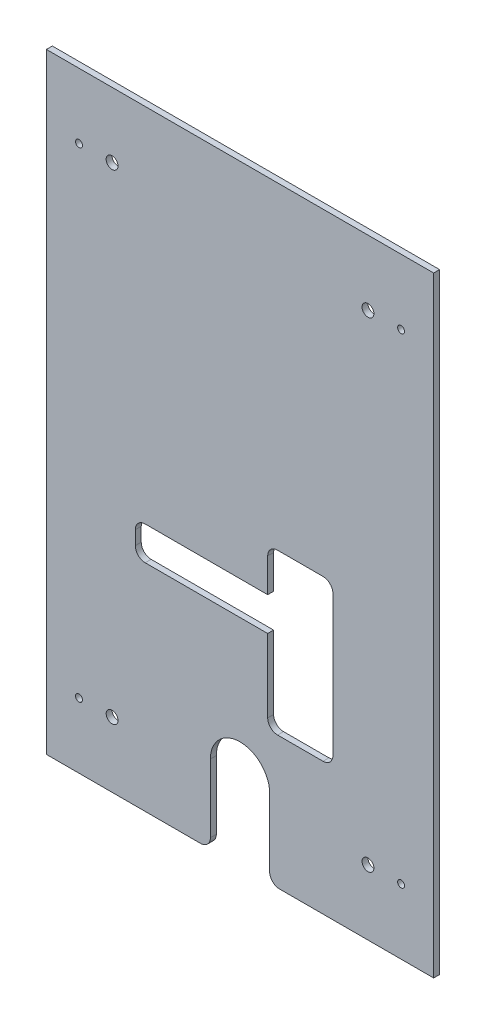
ISO-10303-21;
HEADER;
FILE_DESCRIPTION(('STEP AP214'),'2;1');
FILE_NAME('part.step','',(''),(''),'','','');
FILE_SCHEMA(('AUTOMOTIVE_DESIGN { 1 0 10303 214 1 1 1 1 }'));
ENDSEC;
DATA;
#1=APPLICATION_CONTEXT('core data for automotive mechanical design processes');
#2=APPLICATION_PROTOCOL_DEFINITION('international standard','automotive_design',2000,#1);
#3=PRODUCT_CONTEXT('',#1,'mechanical');
#4=PRODUCT('Part','Part','',(#3));
#5=PRODUCT_RELATED_PRODUCT_CATEGORY('part','',(#4));
#6=PRODUCT_DEFINITION_FORMATION('','',#4);
#7=PRODUCT_DEFINITION_CONTEXT('part definition',#1,'design');
#8=PRODUCT_DEFINITION('design','',#6,#7);
#9=PRODUCT_DEFINITION_SHAPE('','',#8);
#10=(LENGTH_UNIT() NAMED_UNIT(*) SI_UNIT(.MILLI.,.METRE.));
#11=(NAMED_UNIT(*) PLANE_ANGLE_UNIT() SI_UNIT($,.RADIAN.));
#12=(NAMED_UNIT(*) SI_UNIT($,.STERADIAN.) SOLID_ANGLE_UNIT());
#13=UNCERTAINTY_MEASURE_WITH_UNIT(LENGTH_MEASURE(1.E-05),#10,'distance_accuracy_value','');
#14=(GEOMETRIC_REPRESENTATION_CONTEXT(3) GLOBAL_UNCERTAINTY_ASSIGNED_CONTEXT((#13)) GLOBAL_UNIT_ASSIGNED_CONTEXT((#10,
#11,#12)) REPRESENTATION_CONTEXT('',''));
#15=CARTESIAN_POINT('',(0.,0.,0.));
#16=DIRECTION('',(0.,0.,1.));
#17=DIRECTION('',(1.,0.,0.));
#18=AXIS2_PLACEMENT_3D('',#15,#16,#17);
#19=CARTESIAN_POINT('',(98.,-154.5,3.));
#20=DIRECTION('',(0.,1.,0.));
#21=DIRECTION('',(0.,0.,1.));
#22=AXIS2_PLACEMENT_3D('',#19,#20,#21);
#23=PLANE('',#22);
#24=DIRECTION('',(1.,0.,0.));
#25=VECTOR('',#24,1.);
#26=CARTESIAN_POINT('',(98.,-154.5,0.));
#27=LINE('',#26,#25);
#28=CARTESIAN_POINT('',(-98.,-154.5,0.));
#29=VERTEX_POINT('',#28);
#30=CARTESIAN_POINT('',(-20.,-154.5,0.));
#31=VERTEX_POINT('',#30);
#32=EDGE_CURVE('E338',#29,#31,#27,.T.);
#33=ORIENTED_EDGE('',*,*,#32,.T.);
#34=DIRECTION('',(0.,0.,-1.));
#35=VECTOR('',#34,1.);
#36=CARTESIAN_POINT('',(-20.,-154.5,3.));
#37=LINE('',#36,#35);
#38=CARTESIAN_POINT('',(-20.,-154.5,3.));
#39=VERTEX_POINT('',#38);
#40=EDGE_CURVE('E371',#31,#39,#37,.F.);
#41=ORIENTED_EDGE('',*,*,#40,.T.);
#42=DIRECTION('',(1.,0.,0.));
#43=VECTOR('',#42,1.);
#44=CARTESIAN_POINT('',(98.,-154.5,3.));
#45=LINE('',#44,#43);
#46=CARTESIAN_POINT('',(-98.,-154.5,3.));
#47=VERTEX_POINT('',#46);
#48=EDGE_CURVE('E327',#47,#39,#45,.T.);
#49=ORIENTED_EDGE('',*,*,#48,.F.);
#50=DIRECTION('',(0.,0.,-1.));
#51=VECTOR('',#50,1.);
#52=CARTESIAN_POINT('',(-98.,-154.5,3.));
#53=LINE('',#52,#51);
#54=EDGE_CURVE('E352',#47,#29,#53,.T.);
#55=ORIENTED_EDGE('',*,*,#54,.T.);
#56=EDGE_LOOP('',(#33,#41,#49,#55));
#57=FACE_BOUND('',#56,.T.);
#58=ADVANCED_FACE('F45',(#57),#23,.F.);
#59=CARTESIAN_POINT('',(0.,0.,3.));
#60=DIRECTION('',(0.,0.,-1.));
#61=DIRECTION('',(-1.,0.,0.));
#62=AXIS2_PLACEMENT_3D('',#59,#60,#61);
#63=PLANE('',#62);
#64=DIRECTION('',(1.,0.,0.));
#65=VECTOR('',#64,1.);
#66=CARTESIAN_POINT('',(-53.,-45.5,3.));
#67=LINE('',#66,#65);
#68=CARTESIAN_POINT('',(-48.,-45.5,3.));
#69=VERTEX_POINT('',#68);
#70=CARTESIAN_POINT('',(14.,-45.5,3.));
#71=VERTEX_POINT('',#70);
#72=EDGE_CURVE('E235',#69,#71,#67,.T.);
#73=ORIENTED_EDGE('',*,*,#72,.F.);
#74=CARTESIAN_POINT('',(-48.,-40.5,3.));
#75=DIRECTION('',(0.,0.,-1.));
#76=DIRECTION('',(-1.,0.,0.));
#77=AXIS2_PLACEMENT_3D('',#74,#75,#76);
#78=CIRCLE('',#77,5.);
#79=CARTESIAN_POINT('',(-53.,-40.5,3.));
#80=VERTEX_POINT('',#79);
#81=EDGE_CURVE('E401',#69,#80,#78,.T.);
#82=ORIENTED_EDGE('',*,*,#81,.T.);
#83=DIRECTION('',(0.,-1.,0.));
#84=VECTOR('',#83,1.);
#85=CARTESIAN_POINT('',(-53.,-28.5,3.));
#86=LINE('',#85,#84);
#87=CARTESIAN_POINT('',(-53.,-33.5,3.));
#88=VERTEX_POINT('',#87);
#89=EDGE_CURVE('E232',#88,#80,#86,.T.);
#90=ORIENTED_EDGE('',*,*,#89,.F.);
#91=CARTESIAN_POINT('',(-48.,-33.5,3.));
#92=DIRECTION('',(0.,0.,-1.));
#93=DIRECTION('',(-1.,0.,0.));
#94=AXIS2_PLACEMENT_3D('',#91,#92,#93);
#95=CIRCLE('',#94,5.);
#96=CARTESIAN_POINT('',(-48.,-28.5,3.));
#97=VERTEX_POINT('',#96);
#98=EDGE_CURVE('E405',#88,#97,#95,.T.);
#99=ORIENTED_EDGE('',*,*,#98,.T.);
#100=DIRECTION('',(-1.,0.,0.));
#101=VECTOR('',#100,1.);
#102=CARTESIAN_POINT('',(-53.,-28.5,3.));
#103=LINE('',#102,#101);
#104=CARTESIAN_POINT('',(14.,-28.5,3.));
#105=VERTEX_POINT('',#104);
#106=EDGE_CURVE('E250',#105,#97,#103,.T.);
#107=ORIENTED_EDGE('',*,*,#106,.F.);
#108=DIRECTION('',(0.,-1.,0.));
#109=VECTOR('',#108,1.);
#110=CARTESIAN_POINT('',(14.,-6.5,3.));
#111=LINE('',#110,#109);
#112=CARTESIAN_POINT('',(14.,-11.5,3.));
#113=VERTEX_POINT('',#112);
#114=EDGE_CURVE('E217',#113,#105,#111,.T.);
#115=ORIENTED_EDGE('',*,*,#114,.F.);
#116=CARTESIAN_POINT('',(19.,-11.5,3.));
#117=DIRECTION('',(0.,0.,-1.));
#118=DIRECTION('',(-1.,0.,0.));
#119=AXIS2_PLACEMENT_3D('',#116,#117,#118);
#120=CIRCLE('',#119,5.);
#121=CARTESIAN_POINT('',(19.,-6.5,3.));
#122=VERTEX_POINT('',#121);
#123=EDGE_CURVE('E53',#113,#122,#120,.T.);
#124=ORIENTED_EDGE('',*,*,#123,.T.);
#125=DIRECTION('',(-1.,0.,0.));
#126=VECTOR('',#125,1.);
#127=CARTESIAN_POINT('',(47.,-6.49999999999999,3.));
#128=LINE('',#127,#126);
#129=CARTESIAN_POINT('',(42.,-6.49999999999999,3.));
#130=VERTEX_POINT('',#129);
#131=EDGE_CURVE('E246',#130,#122,#128,.T.);
#132=ORIENTED_EDGE('',*,*,#131,.F.);
#133=CARTESIAN_POINT('',(42.,-11.5,3.));
#134=DIRECTION('',(0.,0.,-1.));
#135=DIRECTION('',(-1.,0.,0.));
#136=AXIS2_PLACEMENT_3D('',#133,#134,#135);
#137=CIRCLE('',#136,5.);
#138=CARTESIAN_POINT('',(47.,-11.5,3.));
#139=VERTEX_POINT('',#138);
#140=EDGE_CURVE('E417',#130,#139,#137,.T.);
#141=ORIENTED_EDGE('',*,*,#140,.T.);
#142=DIRECTION('',(0.,1.,0.));
#143=VECTOR('',#142,1.);
#144=CARTESIAN_POINT('',(47.,-6.49999999999999,3.));
#145=LINE('',#144,#143);
#146=CARTESIAN_POINT('',(47.,-82.5,3.));
#147=VERTEX_POINT('',#146);
#148=EDGE_CURVE('E243',#147,#139,#145,.T.);
#149=ORIENTED_EDGE('',*,*,#148,.F.);
#150=CARTESIAN_POINT('',(42.,-82.5,3.));
#151=DIRECTION('',(0.,0.,-1.));
#152=DIRECTION('',(-1.,0.,0.));
#153=AXIS2_PLACEMENT_3D('',#150,#151,#152);
#154=CIRCLE('',#153,5.);
#155=CARTESIAN_POINT('',(42.,-87.5,3.));
#156=VERTEX_POINT('',#155);
#157=EDGE_CURVE('E413',#147,#156,#154,.T.);
#158=ORIENTED_EDGE('',*,*,#157,.T.);
#159=DIRECTION('',(1.,0.,0.));
#160=VECTOR('',#159,1.);
#161=CARTESIAN_POINT('',(47.,-87.5,3.));
#162=LINE('',#161,#160);
#163=CARTESIAN_POINT('',(19.,-87.5,3.));
#164=VERTEX_POINT('',#163);
#165=EDGE_CURVE('E240',#164,#156,#162,.T.);
#166=ORIENTED_EDGE('',*,*,#165,.F.);
#167=CARTESIAN_POINT('',(19.,-82.5,3.));
#168=DIRECTION('',(0.,0.,-1.));
#169=DIRECTION('',(-1.,0.,0.));
#170=AXIS2_PLACEMENT_3D('',#167,#168,#169);
#171=CIRCLE('',#170,5.);
#172=CARTESIAN_POINT('',(14.,-82.5,3.));
#173=VERTEX_POINT('',#172);
#174=EDGE_CURVE('E409',#164,#173,#171,.T.);
#175=ORIENTED_EDGE('',*,*,#174,.T.);
#176=DIRECTION('',(0.,-1.,0.));
#177=VECTOR('',#176,1.);
#178=CARTESIAN_POINT('',(14.,-45.5,3.));
#179=LINE('',#178,#177);
#180=EDGE_CURVE('E237',#71,#173,#179,.T.);
#181=ORIENTED_EDGE('',*,*,#180,.F.);
#182=EDGE_LOOP('',(#73,#82,#90,#99,#107,#115,#124,#132,#141,#149,#158,#166,#175,#181));
#183=FACE_BOUND('',#182,.T.);
#184=DIRECTION('',(0.,1.,0.));
#185=VECTOR('',#184,1.);
#186=CARTESIAN_POINT('',(15.,-154.5,3.));
#187=LINE('',#186,#185);
#188=CARTESIAN_POINT('',(15.,-149.5,3.));
#189=VERTEX_POINT('',#188);
#190=CARTESIAN_POINT('',(15.,-115.,3.));
#191=VERTEX_POINT('',#190);
#192=EDGE_CURVE('E258',#189,#191,#187,.T.);
#193=ORIENTED_EDGE('',*,*,#192,.F.);
#194=CARTESIAN_POINT('',(20.,-149.5,3.));
#195=DIRECTION('',(0.,0.,-1.));
#196=DIRECTION('',(-1.,0.,0.));
#197=AXIS2_PLACEMENT_3D('',#194,#195,#196);
#198=CIRCLE('',#197,5.);
#199=CARTESIAN_POINT('',(20.,-154.5,3.));
#200=VERTEX_POINT('',#199);
#201=EDGE_CURVE('E360',#189,#200,#198,.F.);
#202=ORIENTED_EDGE('',*,*,#201,.T.);
#203=CARTESIAN_POINT('',(98.,-154.5,3.));
#204=VERTEX_POINT('',#203);
#205=EDGE_CURVE('E325',#200,#204,#45,.T.);
#206=ORIENTED_EDGE('',*,*,#205,.T.);
#207=DIRECTION('',(0.,1.,0.));
#208=VECTOR('',#207,1.);
#209=CARTESIAN_POINT('',(98.,154.5,3.));
#210=LINE('',#209,#208);
#211=CARTESIAN_POINT('',(98.,154.5,3.));
#212=VERTEX_POINT('',#211);
#213=EDGE_CURVE('E330',#204,#212,#210,.T.);
#214=ORIENTED_EDGE('',*,*,#213,.T.);
#215=DIRECTION('',(-1.,0.,0.));
#216=VECTOR('',#215,1.);
#217=CARTESIAN_POINT('',(98.,154.5,3.));
#218=LINE('',#217,#216);
#219=CARTESIAN_POINT('',(-98.,154.5,3.));
#220=VERTEX_POINT('',#219);
#221=EDGE_CURVE('E332',#212,#220,#218,.T.);
#222=ORIENTED_EDGE('',*,*,#221,.T.);
#223=DIRECTION('',(0.,-1.,0.));
#224=VECTOR('',#223,1.);
#225=CARTESIAN_POINT('',(-98.,154.5,3.));
#226=LINE('',#225,#224);
#227=EDGE_CURVE('E322',#220,#47,#226,.T.);
#228=ORIENTED_EDGE('',*,*,#227,.T.);
#229=ORIENTED_EDGE('',*,*,#48,.T.);
#230=CARTESIAN_POINT('',(-20.,-149.5,3.));
#231=DIRECTION('',(0.,0.,-1.));
#232=DIRECTION('',(-1.,0.,0.));
#233=AXIS2_PLACEMENT_3D('',#230,#231,#232);
#234=CIRCLE('',#233,5.);
#235=CARTESIAN_POINT('',(-15.,-149.5,3.));
#236=VERTEX_POINT('',#235);
#237=EDGE_CURVE('E358',#39,#236,#234,.F.);
#238=ORIENTED_EDGE('',*,*,#237,.T.);
#239=DIRECTION('',(0.,-1.,0.));
#240=VECTOR('',#239,1.);
#241=CARTESIAN_POINT('',(-15.,-154.5,3.));
#242=LINE('',#241,#240);
#243=CARTESIAN_POINT('',(-15.,-115.,3.));
#244=VERTEX_POINT('',#243);
#245=EDGE_CURVE('E263',#244,#236,#242,.T.);
#246=ORIENTED_EDGE('',*,*,#245,.F.);
#247=CARTESIAN_POINT('',(0.,-115.,3.));
#248=DIRECTION('',(0.,0.,1.));
#249=DIRECTION('',(1.,0.,0.));
#250=AXIS2_PLACEMENT_3D('',#247,#248,#249);
#251=CIRCLE('',#250,15.);
#252=EDGE_CURVE('E260',#191,#244,#251,.T.);
#253=ORIENTED_EDGE('',*,*,#252,.F.);
#254=EDGE_LOOP('',(#193,#202,#206,#214,#222,#228,#229,#238,#246,#253));
#255=FACE_BOUND('',#254,.T.);
#256=CARTESIAN_POINT('',(-81.5,121.5,3.));
#257=DIRECTION('',(0.,0.,1.));
#258=DIRECTION('',(1.,0.,0.));
#259=AXIS2_PLACEMENT_3D('',#256,#257,#258);
#260=CIRCLE('',#259,1.75);
#261=CARTESIAN_POINT('',(-79.75,121.5,3.));
#262=VERTEX_POINT('',#261);
#263=EDGE_CURVE('E316',#262,#262,#260,.T.);
#264=ORIENTED_EDGE('',*,*,#263,.F.);
#265=EDGE_LOOP('',(#264));
#266=FACE_BOUND('',#265,.T.);
#267=CARTESIAN_POINT('',(81.5,121.5,3.));
#268=DIRECTION('',(0.,0.,1.));
#269=DIRECTION('',(-1.,0.,0.));
#270=AXIS2_PLACEMENT_3D('',#267,#268,#269);
#271=CIRCLE('',#270,1.75);
#272=CARTESIAN_POINT('',(79.75,121.5,3.));
#273=VERTEX_POINT('',#272);
#274=EDGE_CURVE('E310',#273,#273,#271,.T.);
#275=ORIENTED_EDGE('',*,*,#274,.F.);
#276=EDGE_LOOP('',(#275));
#277=FACE_BOUND('',#276,.T.);
#278=CARTESIAN_POINT('',(81.5,-121.5,3.));
#279=DIRECTION('',(0.,0.,1.));
#280=DIRECTION('',(1.,0.,0.));
#281=AXIS2_PLACEMENT_3D('',#278,#279,#280);
#282=CIRCLE('',#281,1.75);
#283=CARTESIAN_POINT('',(83.25,-121.5,3.));
#284=VERTEX_POINT('',#283);
#285=EDGE_CURVE('E304',#284,#284,#282,.T.);
#286=ORIENTED_EDGE('',*,*,#285,.F.);
#287=EDGE_LOOP('',(#286));
#288=FACE_BOUND('',#287,.T.);
#289=CARTESIAN_POINT('',(-81.5,-121.5,3.));
#290=DIRECTION('',(0.,0.,1.));
#291=DIRECTION('',(-1.,0.,0.));
#292=AXIS2_PLACEMENT_3D('',#289,#290,#291);
#293=CIRCLE('',#292,1.75);
#294=CARTESIAN_POINT('',(-83.25,-121.5,3.));
#295=VERTEX_POINT('',#294);
#296=EDGE_CURVE('E298',#295,#295,#293,.T.);
#297=ORIENTED_EDGE('',*,*,#296,.F.);
#298=EDGE_LOOP('',(#297));
#299=FACE_BOUND('',#298,.T.);
#300=CARTESIAN_POINT('',(64.75,121.5,3.));
#301=DIRECTION('',(0.,0.,1.));
#302=DIRECTION('',(1.,0.,0.));
#303=AXIS2_PLACEMENT_3D('',#300,#301,#302);
#304=CIRCLE('',#303,3.00000000000001);
#305=CARTESIAN_POINT('',(67.75,121.5,3.));
#306=VERTEX_POINT('',#305);
#307=EDGE_CURVE('E292',#306,#306,#304,.T.);
#308=ORIENTED_EDGE('',*,*,#307,.F.);
#309=EDGE_LOOP('',(#308));
#310=FACE_BOUND('',#309,.T.);
#311=CARTESIAN_POINT('',(-64.7499999999999,121.5,3.));
#312=DIRECTION('',(0.,0.,1.));
#313=DIRECTION('',(-1.,0.,0.));
#314=AXIS2_PLACEMENT_3D('',#311,#312,#313);
#315=CIRCLE('',#314,3.00000000000001);
#316=CARTESIAN_POINT('',(-67.7499999999999,121.5,3.));
#317=VERTEX_POINT('',#316);
#318=EDGE_CURVE('E286',#317,#317,#315,.T.);
#319=ORIENTED_EDGE('',*,*,#318,.F.);
#320=EDGE_LOOP('',(#319));
#321=FACE_BOUND('',#320,.T.);
#322=CARTESIAN_POINT('',(-64.7499999999999,-121.5,3.));
#323=DIRECTION('',(0.,0.,1.));
#324=DIRECTION('',(1.,0.,0.));
#325=AXIS2_PLACEMENT_3D('',#322,#323,#324);
#326=CIRCLE('',#325,3.00000000000001);
#327=CARTESIAN_POINT('',(-61.7499999999999,-121.5,3.));
#328=VERTEX_POINT('',#327);
#329=EDGE_CURVE('E280',#328,#328,#326,.T.);
#330=ORIENTED_EDGE('',*,*,#329,.F.);
#331=EDGE_LOOP('',(#330));
#332=FACE_BOUND('',#331,.T.);
#333=CARTESIAN_POINT('',(64.7500000000001,-121.5,3.));
#334=DIRECTION('',(0.,0.,1.));
#335=DIRECTION('',(-1.,0.,0.));
#336=AXIS2_PLACEMENT_3D('',#333,#334,#335);
#337=CIRCLE('',#336,3.00000000000001);
#338=CARTESIAN_POINT('',(61.75,-121.5,3.));
#339=VERTEX_POINT('',#338);
#340=EDGE_CURVE('E274',#339,#339,#337,.T.);
#341=ORIENTED_EDGE('',*,*,#340,.F.);
#342=EDGE_LOOP('',(#341));
#343=FACE_BOUND('',#342,.T.);
#344=ADVANCED_FACE('F423',(#183,#255,#266,#277,#288,#299,#310,#321,#332,#343),#63,.F.);
#345=CARTESIAN_POINT('',(0.,0.,0.));
#346=DIRECTION('',(0.,0.,-1.));
#347=DIRECTION('',(-1.,0.,0.));
#348=AXIS2_PLACEMENT_3D('',#345,#346,#347);
#349=PLANE('',#348);
#350=DIRECTION('',(-1.,0.,0.));
#351=VECTOR('',#350,1.);
#352=CARTESIAN_POINT('',(-53.,-28.5,0.));
#353=LINE('',#352,#351);
#354=CARTESIAN_POINT('',(14.,-28.5,0.));
#355=VERTEX_POINT('',#354);
#356=CARTESIAN_POINT('',(-48.,-28.5,0.));
#357=VERTEX_POINT('',#356);
#358=EDGE_CURVE('E208',#355,#357,#353,.T.);
#359=ORIENTED_EDGE('',*,*,#358,.T.);
#360=CARTESIAN_POINT('',(-48.,-33.5,0.));
#361=DIRECTION('',(0.,0.,-1.));
#362=DIRECTION('',(-1.,0.,0.));
#363=AXIS2_PLACEMENT_3D('',#360,#361,#362);
#364=CIRCLE('',#363,5.);
#365=CARTESIAN_POINT('',(-53.,-33.5,0.));
#366=VERTEX_POINT('',#365);
#367=EDGE_CURVE('E407',#357,#366,#364,.F.);
#368=ORIENTED_EDGE('',*,*,#367,.T.);
#369=DIRECTION('',(0.,-1.,0.));
#370=VECTOR('',#369,1.);
#371=CARTESIAN_POINT('',(-53.,-28.5,0.));
#372=LINE('',#371,#370);
#373=CARTESIAN_POINT('',(-53.,-40.5,0.));
#374=VERTEX_POINT('',#373);
#375=EDGE_CURVE('E251',#366,#374,#372,.T.);
#376=ORIENTED_EDGE('',*,*,#375,.T.);
#377=CARTESIAN_POINT('',(-48.,-40.5,0.));
#378=DIRECTION('',(0.,0.,-1.));
#379=DIRECTION('',(-1.,0.,0.));
#380=AXIS2_PLACEMENT_3D('',#377,#378,#379);
#381=CIRCLE('',#380,5.);
#382=CARTESIAN_POINT('',(-48.,-45.5,0.));
#383=VERTEX_POINT('',#382);
#384=EDGE_CURVE('E403',#374,#383,#381,.F.);
#385=ORIENTED_EDGE('',*,*,#384,.T.);
#386=DIRECTION('',(1.,0.,0.));
#387=VECTOR('',#386,1.);
#388=CARTESIAN_POINT('',(-53.,-45.5,0.));
#389=LINE('',#388,#387);
#390=CARTESIAN_POINT('',(14.,-45.5,0.));
#391=VERTEX_POINT('',#390);
#392=EDGE_CURVE('E798',#383,#391,#389,.T.);
#393=ORIENTED_EDGE('',*,*,#392,.T.);
#394=DIRECTION('',(0.,-1.,0.));
#395=VECTOR('',#394,1.);
#396=CARTESIAN_POINT('',(14.,-45.5,0.));
#397=LINE('',#396,#395);
#398=CARTESIAN_POINT('',(14.,-82.5,0.));
#399=VERTEX_POINT('',#398);
#400=EDGE_CURVE('E793',#391,#399,#397,.T.);
#401=ORIENTED_EDGE('',*,*,#400,.T.);
#402=CARTESIAN_POINT('',(19.,-82.5,0.));
#403=DIRECTION('',(0.,0.,-1.));
#404=DIRECTION('',(-1.,0.,0.));
#405=AXIS2_PLACEMENT_3D('',#402,#403,#404);
#406=CIRCLE('',#405,5.);
#407=CARTESIAN_POINT('',(19.,-87.5,0.));
#408=VERTEX_POINT('',#407);
#409=EDGE_CURVE('E411',#399,#408,#406,.F.);
#410=ORIENTED_EDGE('',*,*,#409,.T.);
#411=DIRECTION('',(1.,0.,0.));
#412=VECTOR('',#411,1.);
#413=CARTESIAN_POINT('',(47.,-87.5,0.));
#414=LINE('',#413,#412);
#415=CARTESIAN_POINT('',(42.,-87.5,0.));
#416=VERTEX_POINT('',#415);
#417=EDGE_CURVE('E789',#408,#416,#414,.T.);
#418=ORIENTED_EDGE('',*,*,#417,.T.);
#419=CARTESIAN_POINT('',(42.,-82.5,0.));
#420=DIRECTION('',(0.,0.,-1.));
#421=DIRECTION('',(-1.,0.,0.));
#422=AXIS2_PLACEMENT_3D('',#419,#420,#421);
#423=CIRCLE('',#422,5.);
#424=CARTESIAN_POINT('',(47.,-82.5,0.));
#425=VERTEX_POINT('',#424);
#426=EDGE_CURVE('E415',#416,#425,#423,.F.);
#427=ORIENTED_EDGE('',*,*,#426,.T.);
#428=DIRECTION('',(0.,1.,0.));
#429=VECTOR('',#428,1.);
#430=CARTESIAN_POINT('',(47.,-6.49999999999999,0.));
#431=LINE('',#430,#429);
#432=CARTESIAN_POINT('',(47.,-11.5,0.));
#433=VERTEX_POINT('',#432);
#434=EDGE_CURVE('E786',#425,#433,#431,.T.);
#435=ORIENTED_EDGE('',*,*,#434,.T.);
#436=CARTESIAN_POINT('',(42.,-11.5,0.));
#437=DIRECTION('',(0.,0.,-1.));
#438=DIRECTION('',(-1.,0.,0.));
#439=AXIS2_PLACEMENT_3D('',#436,#437,#438);
#440=CIRCLE('',#439,5.);
#441=CARTESIAN_POINT('',(42.,-6.49999999999999,0.));
#442=VERTEX_POINT('',#441);
#443=EDGE_CURVE('E419',#433,#442,#440,.F.);
#444=ORIENTED_EDGE('',*,*,#443,.T.);
#445=DIRECTION('',(-1.,0.,0.));
#446=VECTOR('',#445,1.);
#447=CARTESIAN_POINT('',(47.,-6.49999999999999,0.));
#448=LINE('',#447,#446);
#449=CARTESIAN_POINT('',(19.,-6.5,0.));
#450=VERTEX_POINT('',#449);
#451=EDGE_CURVE('E211',#442,#450,#448,.T.);
#452=ORIENTED_EDGE('',*,*,#451,.T.);
#453=CARTESIAN_POINT('',(19.,-11.5,0.));
#454=DIRECTION('',(0.,0.,-1.));
#455=DIRECTION('',(-1.,0.,0.));
#456=AXIS2_PLACEMENT_3D('',#453,#454,#455);
#457=CIRCLE('',#456,5.);
#458=CARTESIAN_POINT('',(14.,-11.5,0.));
#459=VERTEX_POINT('',#458);
#460=EDGE_CURVE('E11',#450,#459,#457,.F.);
#461=ORIENTED_EDGE('',*,*,#460,.T.);
#462=DIRECTION('',(0.,-1.,0.));
#463=VECTOR('',#462,1.);
#464=CARTESIAN_POINT('',(14.,-6.5,0.));
#465=LINE('',#464,#463);
#466=EDGE_CURVE('E203',#459,#355,#465,.T.);
#467=ORIENTED_EDGE('',*,*,#466,.T.);
#468=EDGE_LOOP('',(#359,#368,#376,#385,#393,#401,#410,#418,#427,#435,#444,#452,#461,#467));
#469=FACE_BOUND('',#468,.T.);
#470=CARTESIAN_POINT('',(20.,-154.5,0.));
#471=VERTEX_POINT('',#470);
#472=CARTESIAN_POINT('',(98.,-154.5,0.));
#473=VERTEX_POINT('',#472);
#474=EDGE_CURVE('E337',#471,#473,#27,.T.);
#475=ORIENTED_EDGE('',*,*,#474,.F.);
#476=CARTESIAN_POINT('',(20.,-149.5,0.));
#477=DIRECTION('',(0.,0.,-1.));
#478=DIRECTION('',(-1.,0.,0.));
#479=AXIS2_PLACEMENT_3D('',#476,#477,#478);
#480=CIRCLE('',#479,5.);
#481=CARTESIAN_POINT('',(15.,-149.5,0.));
#482=VERTEX_POINT('',#481);
#483=EDGE_CURVE('E366',#471,#482,#480,.T.);
#484=ORIENTED_EDGE('',*,*,#483,.T.);
#485=DIRECTION('',(0.,1.,0.));
#486=VECTOR('',#485,1.);
#487=CARTESIAN_POINT('',(15.,-154.5,0.));
#488=LINE('',#487,#486);
#489=CARTESIAN_POINT('',(15.,-115.,0.));
#490=VERTEX_POINT('',#489);
#491=EDGE_CURVE('E269',#482,#490,#488,.T.);
#492=ORIENTED_EDGE('',*,*,#491,.T.);
#493=CARTESIAN_POINT('',(0.,-115.,0.));
#494=DIRECTION('',(0.,0.,-1.));
#495=DIRECTION('',(-1.,0.,0.));
#496=AXIS2_PLACEMENT_3D('',#493,#494,#495);
#497=CIRCLE('',#496,15.);
#498=CARTESIAN_POINT('',(-15.,-115.,0.));
#499=VERTEX_POINT('',#498);
#500=EDGE_CURVE('E221',#490,#499,#497,.F.);
#501=ORIENTED_EDGE('',*,*,#500,.T.);
#502=DIRECTION('',(0.,-1.,0.));
#503=VECTOR('',#502,1.);
#504=CARTESIAN_POINT('',(-15.,-154.5,0.));
#505=LINE('',#504,#503);
#506=CARTESIAN_POINT('',(-15.,-149.5,0.));
#507=VERTEX_POINT('',#506);
#508=EDGE_CURVE('E255',#499,#507,#505,.T.);
#509=ORIENTED_EDGE('',*,*,#508,.T.);
#510=CARTESIAN_POINT('',(-20.,-149.5,0.));
#511=DIRECTION('',(0.,0.,-1.));
#512=DIRECTION('',(-1.,0.,0.));
#513=AXIS2_PLACEMENT_3D('',#510,#511,#512);
#514=CIRCLE('',#513,5.);
#515=EDGE_CURVE('E364',#507,#31,#514,.T.);
#516=ORIENTED_EDGE('',*,*,#515,.T.);
#517=ORIENTED_EDGE('',*,*,#32,.F.);
#518=DIRECTION('',(0.,-1.,0.));
#519=VECTOR('',#518,1.);
#520=CARTESIAN_POINT('',(-98.,154.5,0.));
#521=LINE('',#520,#519);
#522=CARTESIAN_POINT('',(-98.,154.5,0.));
#523=VERTEX_POINT('',#522);
#524=EDGE_CURVE('E319',#523,#29,#521,.T.);
#525=ORIENTED_EDGE('',*,*,#524,.F.);
#526=DIRECTION('',(-1.,0.,0.));
#527=VECTOR('',#526,1.);
#528=CARTESIAN_POINT('',(98.,154.5,0.));
#529=LINE('',#528,#527);
#530=CARTESIAN_POINT('',(98.,154.5,0.));
#531=VERTEX_POINT('',#530);
#532=EDGE_CURVE('E326',#531,#523,#529,.T.);
#533=ORIENTED_EDGE('',*,*,#532,.F.);
#534=DIRECTION('',(0.,1.,0.));
#535=VECTOR('',#534,1.);
#536=CARTESIAN_POINT('',(98.,154.5,0.));
#537=LINE('',#536,#535);
#538=EDGE_CURVE('E341',#473,#531,#537,.T.);
#539=ORIENTED_EDGE('',*,*,#538,.F.);
#540=EDGE_LOOP('',(#475,#484,#492,#501,#509,#516,#517,#525,#533,#539));
#541=FACE_BOUND('',#540,.T.);
#542=CARTESIAN_POINT('',(-64.7499999999999,-121.5,0.));
#543=DIRECTION('',(0.,0.,1.));
#544=DIRECTION('',(1.,0.,0.));
#545=AXIS2_PLACEMENT_3D('',#542,#543,#544);
#546=CIRCLE('',#545,3.00000000000001);
#547=CARTESIAN_POINT('',(-61.7499999999999,-121.5,0.));
#548=VERTEX_POINT('',#547);
#549=EDGE_CURVE('E277',#548,#548,#546,.T.);
#550=ORIENTED_EDGE('',*,*,#549,.T.);
#551=EDGE_LOOP('',(#550));
#552=FACE_BOUND('',#551,.T.);
#553=CARTESIAN_POINT('',(64.75,121.5,0.));
#554=DIRECTION('',(0.,0.,1.));
#555=DIRECTION('',(1.,0.,0.));
#556=AXIS2_PLACEMENT_3D('',#553,#554,#555);
#557=CIRCLE('',#556,3.00000000000001);
#558=CARTESIAN_POINT('',(67.75,121.5,0.));
#559=VERTEX_POINT('',#558);
#560=EDGE_CURVE('E289',#559,#559,#557,.T.);
#561=ORIENTED_EDGE('',*,*,#560,.T.);
#562=EDGE_LOOP('',(#561));
#563=FACE_BOUND('',#562,.T.);
#564=CARTESIAN_POINT('',(81.5,-121.5,0.));
#565=DIRECTION('',(0.,0.,1.));
#566=DIRECTION('',(1.,0.,0.));
#567=AXIS2_PLACEMENT_3D('',#564,#565,#566);
#568=CIRCLE('',#567,1.75);
#569=CARTESIAN_POINT('',(83.25,-121.5,0.));
#570=VERTEX_POINT('',#569);
#571=EDGE_CURVE('E301',#570,#570,#568,.T.);
#572=ORIENTED_EDGE('',*,*,#571,.T.);
#573=EDGE_LOOP('',(#572));
#574=FACE_BOUND('',#573,.T.);
#575=CARTESIAN_POINT('',(-81.5,121.5,0.));
#576=DIRECTION('',(0.,0.,1.));
#577=DIRECTION('',(1.,0.,0.));
#578=AXIS2_PLACEMENT_3D('',#575,#576,#577);
#579=CIRCLE('',#578,1.75);
#580=CARTESIAN_POINT('',(-79.75,121.5,0.));
#581=VERTEX_POINT('',#580);
#582=EDGE_CURVE('E313',#581,#581,#579,.T.);
#583=ORIENTED_EDGE('',*,*,#582,.T.);
#584=EDGE_LOOP('',(#583));
#585=FACE_BOUND('',#584,.T.);
#586=CARTESIAN_POINT('',(81.5,121.5,0.));
#587=DIRECTION('',(0.,0.,1.));
#588=DIRECTION('',(-1.,0.,0.));
#589=AXIS2_PLACEMENT_3D('',#586,#587,#588);
#590=CIRCLE('',#589,1.75);
#591=CARTESIAN_POINT('',(79.75,121.5,0.));
#592=VERTEX_POINT('',#591);
#593=EDGE_CURVE('E307',#592,#592,#590,.T.);
#594=ORIENTED_EDGE('',*,*,#593,.T.);
#595=EDGE_LOOP('',(#594));
#596=FACE_BOUND('',#595,.T.);
#597=CARTESIAN_POINT('',(-81.5,-121.5,0.));
#598=DIRECTION('',(0.,0.,1.));
#599=DIRECTION('',(-1.,0.,0.));
#600=AXIS2_PLACEMENT_3D('',#597,#598,#599);
#601=CIRCLE('',#600,1.75);
#602=CARTESIAN_POINT('',(-83.25,-121.5,0.));
#603=VERTEX_POINT('',#602);
#604=EDGE_CURVE('E295',#603,#603,#601,.T.);
#605=ORIENTED_EDGE('',*,*,#604,.T.);
#606=EDGE_LOOP('',(#605));
#607=FACE_BOUND('',#606,.T.);
#608=CARTESIAN_POINT('',(-64.7499999999999,121.5,0.));
#609=DIRECTION('',(0.,0.,1.));
#610=DIRECTION('',(-1.,0.,0.));
#611=AXIS2_PLACEMENT_3D('',#608,#609,#610);
#612=CIRCLE('',#611,3.00000000000001);
#613=CARTESIAN_POINT('',(-67.7499999999999,121.5,0.));
#614=VERTEX_POINT('',#613);
#615=EDGE_CURVE('E283',#614,#614,#612,.T.);
#616=ORIENTED_EDGE('',*,*,#615,.T.);
#617=EDGE_LOOP('',(#616));
#618=FACE_BOUND('',#617,.T.);
#619=CARTESIAN_POINT('',(64.7500000000001,-121.5,0.));
#620=DIRECTION('',(0.,0.,1.));
#621=DIRECTION('',(-1.,0.,0.));
#622=AXIS2_PLACEMENT_3D('',#619,#620,#621);
#623=CIRCLE('',#622,3.00000000000001);
#624=CARTESIAN_POINT('',(61.75,-121.5,0.));
#625=VERTEX_POINT('',#624);
#626=EDGE_CURVE('E273',#625,#625,#623,.T.);
#627=ORIENTED_EDGE('',*,*,#626,.T.);
#628=EDGE_LOOP('',(#627));
#629=FACE_BOUND('',#628,.T.);
#630=ADVANCED_FACE('F205',(#469,#541,#552,#563,#574,#585,#596,#607,#618,#629),#349,.T.);
#631=CARTESIAN_POINT('',(-98.,154.5,3.));
#632=DIRECTION('',(1.,0.,0.));
#633=DIRECTION('',(0.,0.,-1.));
#634=AXIS2_PLACEMENT_3D('',#631,#632,#633);
#635=PLANE('',#634);
#636=ORIENTED_EDGE('',*,*,#524,.T.);
#637=ORIENTED_EDGE('',*,*,#54,.F.);
#638=ORIENTED_EDGE('',*,*,#227,.F.);
#639=DIRECTION('',(0.,0.,-1.));
#640=VECTOR('',#639,1.);
#641=CARTESIAN_POINT('',(-98.,154.5,3.));
#642=LINE('',#641,#640);
#643=EDGE_CURVE('E334',#220,#523,#642,.T.);
#644=ORIENTED_EDGE('',*,*,#643,.T.);
#645=EDGE_LOOP('',(#636,#637,#638,#644));
#646=FACE_BOUND('',#645,.T.);
#647=ADVANCED_FACE('F449',(#646),#635,.F.);
#648=ORIENTED_EDGE('',*,*,#205,.F.);
#649=DIRECTION('',(0.,0.,1.));
#650=VECTOR('',#649,1.);
#651=CARTESIAN_POINT('',(20.,-154.5,3.));
#652=LINE('',#651,#650);
#653=EDGE_CURVE('E362',#200,#471,#652,.F.);
#654=ORIENTED_EDGE('',*,*,#653,.T.);
#655=ORIENTED_EDGE('',*,*,#474,.T.);
#656=DIRECTION('',(0.,0.,-1.));
#657=VECTOR('',#656,1.);
#658=CARTESIAN_POINT('',(98.,-154.5,3.));
#659=LINE('',#658,#657);
#660=EDGE_CURVE('E349',#204,#473,#659,.T.);
#661=ORIENTED_EDGE('',*,*,#660,.F.);
#662=EDGE_LOOP('',(#648,#654,#655,#661));
#663=FACE_BOUND('',#662,.T.);
#664=ADVANCED_FACE('F439',(#663),#23,.F.);
#665=CARTESIAN_POINT('',(98.,154.5,3.));
#666=DIRECTION('',(-1.,0.,0.));
#667=DIRECTION('',(0.,0.,1.));
#668=AXIS2_PLACEMENT_3D('',#665,#666,#667);
#669=PLANE('',#668);
#670=ORIENTED_EDGE('',*,*,#538,.T.);
#671=DIRECTION('',(0.,0.,-1.));
#672=VECTOR('',#671,1.);
#673=CARTESIAN_POINT('',(98.,154.5,3.));
#674=LINE('',#673,#672);
#675=EDGE_CURVE('E346',#212,#531,#674,.T.);
#676=ORIENTED_EDGE('',*,*,#675,.F.);
#677=ORIENTED_EDGE('',*,*,#213,.F.);
#678=ORIENTED_EDGE('',*,*,#660,.T.);
#679=EDGE_LOOP('',(#670,#676,#677,#678));
#680=FACE_BOUND('',#679,.T.);
#681=ADVANCED_FACE('F448',(#680),#669,.F.);
#682=CARTESIAN_POINT('',(98.,154.5,3.));
#683=DIRECTION('',(0.,-1.,0.));
#684=DIRECTION('',(0.,0.,-1.));
#685=AXIS2_PLACEMENT_3D('',#682,#683,#684);
#686=PLANE('',#685);
#687=ORIENTED_EDGE('',*,*,#532,.T.);
#688=ORIENTED_EDGE('',*,*,#643,.F.);
#689=ORIENTED_EDGE('',*,*,#221,.F.);
#690=ORIENTED_EDGE('',*,*,#675,.T.);
#691=EDGE_LOOP('',(#687,#688,#689,#690));
#692=FACE_BOUND('',#691,.T.);
#693=ADVANCED_FACE('F455',(#692),#686,.F.);
#694=CARTESIAN_POINT('',(-81.5,121.5,3.));
#695=DIRECTION('',(0.,0.,-1.));
#696=DIRECTION('',(-1.,0.,0.));
#697=AXIS2_PLACEMENT_3D('',#694,#695,#696);
#698=CYLINDRICAL_SURFACE('',#697,1.75);
#699=ORIENTED_EDGE('',*,*,#263,.T.);
#700=EDGE_LOOP('',(#699));
#701=FACE_BOUND('',#700,.T.);
#702=ORIENTED_EDGE('',*,*,#582,.F.);
#703=EDGE_LOOP('',(#702));
#704=FACE_BOUND('',#703,.T.);
#705=ADVANCED_FACE('F498',(#701,#704),#698,.F.);
#706=CARTESIAN_POINT('',(81.5,121.5,3.));
#707=DIRECTION('',(0.,0.,-1.));
#708=DIRECTION('',(-1.,0.,0.));
#709=AXIS2_PLACEMENT_3D('',#706,#707,#708);
#710=CYLINDRICAL_SURFACE('',#709,1.75);
#711=ORIENTED_EDGE('',*,*,#274,.T.);
#712=EDGE_LOOP('',(#711));
#713=FACE_BOUND('',#712,.T.);
#714=ORIENTED_EDGE('',*,*,#593,.F.);
#715=EDGE_LOOP('',(#714));
#716=FACE_BOUND('',#715,.T.);
#717=ADVANCED_FACE('F503',(#713,#716),#710,.F.);
#718=CARTESIAN_POINT('',(81.5,-121.5,3.));
#719=DIRECTION('',(0.,0.,-1.));
#720=DIRECTION('',(-1.,0.,0.));
#721=AXIS2_PLACEMENT_3D('',#718,#719,#720);
#722=CYLINDRICAL_SURFACE('',#721,1.75);
#723=ORIENTED_EDGE('',*,*,#285,.T.);
#724=EDGE_LOOP('',(#723));
#725=FACE_BOUND('',#724,.T.);
#726=ORIENTED_EDGE('',*,*,#571,.F.);
#727=EDGE_LOOP('',(#726));
#728=FACE_BOUND('',#727,.T.);
#729=ADVANCED_FACE('F511',(#725,#728),#722,.F.);
#730=CARTESIAN_POINT('',(-81.5,-121.5,3.));
#731=DIRECTION('',(0.,0.,-1.));
#732=DIRECTION('',(-1.,0.,0.));
#733=AXIS2_PLACEMENT_3D('',#730,#731,#732);
#734=CYLINDRICAL_SURFACE('',#733,1.75);
#735=ORIENTED_EDGE('',*,*,#296,.T.);
#736=EDGE_LOOP('',(#735));
#737=FACE_BOUND('',#736,.T.);
#738=ORIENTED_EDGE('',*,*,#604,.F.);
#739=EDGE_LOOP('',(#738));
#740=FACE_BOUND('',#739,.T.);
#741=ADVANCED_FACE('F515',(#737,#740),#734,.F.);
#742=CARTESIAN_POINT('',(64.75,121.5,3.));
#743=DIRECTION('',(0.,0.,-1.));
#744=DIRECTION('',(-1.,0.,0.));
#745=AXIS2_PLACEMENT_3D('',#742,#743,#744);
#746=CYLINDRICAL_SURFACE('',#745,3.00000000000001);
#747=ORIENTED_EDGE('',*,*,#307,.T.);
#748=EDGE_LOOP('',(#747));
#749=FACE_BOUND('',#748,.T.);
#750=ORIENTED_EDGE('',*,*,#560,.F.);
#751=EDGE_LOOP('',(#750));
#752=FACE_BOUND('',#751,.T.);
#753=ADVANCED_FACE('F519',(#749,#752),#746,.F.);
#754=CARTESIAN_POINT('',(-64.7499999999999,121.5,3.));
#755=DIRECTION('',(0.,0.,-1.));
#756=DIRECTION('',(-1.,0.,0.));
#757=AXIS2_PLACEMENT_3D('',#754,#755,#756);
#758=CYLINDRICAL_SURFACE('',#757,3.00000000000001);
#759=ORIENTED_EDGE('',*,*,#318,.T.);
#760=EDGE_LOOP('',(#759));
#761=FACE_BOUND('',#760,.T.);
#762=ORIENTED_EDGE('',*,*,#615,.F.);
#763=EDGE_LOOP('',(#762));
#764=FACE_BOUND('',#763,.T.);
#765=ADVANCED_FACE('F523',(#761,#764),#758,.F.);
#766=CARTESIAN_POINT('',(-64.7499999999999,-121.5,3.));
#767=DIRECTION('',(0.,0.,-1.));
#768=DIRECTION('',(-1.,0.,0.));
#769=AXIS2_PLACEMENT_3D('',#766,#767,#768);
#770=CYLINDRICAL_SURFACE('',#769,3.00000000000001);
#771=ORIENTED_EDGE('',*,*,#329,.T.);
#772=EDGE_LOOP('',(#771));
#773=FACE_BOUND('',#772,.T.);
#774=ORIENTED_EDGE('',*,*,#549,.F.);
#775=EDGE_LOOP('',(#774));
#776=FACE_BOUND('',#775,.T.);
#777=ADVANCED_FACE('F527',(#773,#776),#770,.F.);
#778=CARTESIAN_POINT('',(64.7500000000001,-121.5,3.));
#779=DIRECTION('',(0.,0.,-1.));
#780=DIRECTION('',(-1.,0.,0.));
#781=AXIS2_PLACEMENT_3D('',#778,#779,#780);
#782=CYLINDRICAL_SURFACE('',#781,3.00000000000001);
#783=ORIENTED_EDGE('',*,*,#340,.T.);
#784=EDGE_LOOP('',(#783));
#785=FACE_BOUND('',#784,.T.);
#786=ORIENTED_EDGE('',*,*,#626,.F.);
#787=EDGE_LOOP('',(#786));
#788=FACE_BOUND('',#787,.T.);
#789=ADVANCED_FACE('F531',(#785,#788),#782,.F.);
#790=CARTESIAN_POINT('',(-15.,-154.5,-0.00100000000000013));
#791=DIRECTION('',(-1.,0.,0.));
#792=DIRECTION('',(0.,0.,1.));
#793=AXIS2_PLACEMENT_3D('',#790,#791,#792);
#794=PLANE('',#793);
#795=ORIENTED_EDGE('',*,*,#245,.T.);
#796=DIRECTION('',(0.,0.,-1.));
#797=VECTOR('',#796,1.);
#798=CARTESIAN_POINT('',(-15.,-149.5,-0.00100000000000013));
#799=LINE('',#798,#797);
#800=EDGE_CURVE('E368',#236,#507,#799,.T.);
#801=ORIENTED_EDGE('',*,*,#800,.T.);
#802=ORIENTED_EDGE('',*,*,#508,.F.);
#803=DIRECTION('',(0.,0.,1.));
#804=VECTOR('',#803,1.);
#805=CARTESIAN_POINT('',(-15.,-115.,-0.00100000000000013));
#806=LINE('',#805,#804);
#807=EDGE_CURVE('E267',#499,#244,#806,.T.);
#808=ORIENTED_EDGE('',*,*,#807,.T.);
#809=EDGE_LOOP('',(#795,#801,#802,#808));
#810=FACE_BOUND('',#809,.T.);
#811=ADVANCED_FACE('F481',(#810),#794,.F.);
#812=CARTESIAN_POINT('',(0.,-115.,-0.00100000000000013));
#813=DIRECTION('',(0.,0.,1.));
#814=DIRECTION('',(1.,0.,0.));
#815=AXIS2_PLACEMENT_3D('',#812,#813,#814);
#816=CYLINDRICAL_SURFACE('',#815,15.);
#817=DIRECTION('',(0.,0.,1.));
#818=VECTOR('',#817,1.);
#819=CARTESIAN_POINT('',(15.,-115.,-0.00100000000000013));
#820=LINE('',#819,#818);
#821=EDGE_CURVE('E266',#490,#191,#820,.T.);
#822=ORIENTED_EDGE('',*,*,#821,.T.);
#823=ORIENTED_EDGE('',*,*,#252,.T.);
#824=ORIENTED_EDGE('',*,*,#807,.F.);
#825=ORIENTED_EDGE('',*,*,#500,.F.);
#826=EDGE_LOOP('',(#822,#823,#824,#825));
#827=FACE_BOUND('',#826,.T.);
#828=ADVANCED_FACE('F478',(#827),#816,.F.);
#829=CARTESIAN_POINT('',(15.,-154.5,-0.00100000000000013));
#830=DIRECTION('',(1.,0.,0.));
#831=DIRECTION('',(0.,0.,-1.));
#832=AXIS2_PLACEMENT_3D('',#829,#830,#831);
#833=PLANE('',#832);
#834=ORIENTED_EDGE('',*,*,#491,.F.);
#835=DIRECTION('',(0.,0.,1.));
#836=VECTOR('',#835,1.);
#837=CARTESIAN_POINT('',(15.,-149.5,-0.00100000000000013));
#838=LINE('',#837,#836);
#839=EDGE_CURVE('E355',#482,#189,#838,.T.);
#840=ORIENTED_EDGE('',*,*,#839,.T.);
#841=ORIENTED_EDGE('',*,*,#192,.T.);
#842=ORIENTED_EDGE('',*,*,#821,.F.);
#843=EDGE_LOOP('',(#834,#840,#841,#842));
#844=FACE_BOUND('',#843,.T.);
#845=ADVANCED_FACE('F473',(#844),#833,.F.);
#846=CARTESIAN_POINT('',(20.,-149.5,-0.00100000000000013));
#847=DIRECTION('',(0.,0.,1.));
#848=DIRECTION('',(1.,0.,0.));
#849=AXIS2_PLACEMENT_3D('',#846,#847,#848);
#850=CYLINDRICAL_SURFACE('',#849,5.);
#851=ORIENTED_EDGE('',*,*,#483,.F.);
#852=ORIENTED_EDGE('',*,*,#653,.F.);
#853=ORIENTED_EDGE('',*,*,#201,.F.);
#854=ORIENTED_EDGE('',*,*,#839,.F.);
#855=EDGE_LOOP('',(#851,#852,#853,#854));
#856=FACE_BOUND('',#855,.T.);
#857=ADVANCED_FACE('F466',(#856),#850,.T.);
#858=CARTESIAN_POINT('',(-20.,-149.5,-0.00100000000000013));
#859=DIRECTION('',(0.,0.,-1.));
#860=DIRECTION('',(-1.,0.,0.));
#861=AXIS2_PLACEMENT_3D('',#858,#859,#860);
#862=CYLINDRICAL_SURFACE('',#861,5.);
#863=ORIENTED_EDGE('',*,*,#237,.F.);
#864=ORIENTED_EDGE('',*,*,#40,.F.);
#865=ORIENTED_EDGE('',*,*,#515,.F.);
#866=ORIENTED_EDGE('',*,*,#800,.F.);
#867=EDGE_LOOP('',(#863,#864,#865,#866));
#868=FACE_BOUND('',#867,.T.);
#869=ADVANCED_FACE('F486',(#868),#862,.T.);
#870=CARTESIAN_POINT('',(-53.,-28.5,0.));
#871=DIRECTION('',(-1.,0.,0.));
#872=DIRECTION('',(0.,0.,1.));
#873=AXIS2_PLACEMENT_3D('',#870,#871,#872);
#874=PLANE('',#873);
#875=ORIENTED_EDGE('',*,*,#89,.T.);
#876=DIRECTION('',(0.,0.,1.));
#877=VECTOR('',#876,1.);
#878=CARTESIAN_POINT('',(-53.,-40.5,0.));
#879=LINE('',#878,#877);
#880=EDGE_CURVE('E379',#80,#374,#879,.F.);
#881=ORIENTED_EDGE('',*,*,#880,.T.);
#882=ORIENTED_EDGE('',*,*,#375,.F.);
#883=DIRECTION('',(0.,0.,1.));
#884=VECTOR('',#883,1.);
#885=CARTESIAN_POINT('',(-53.,-33.5,3.));
#886=LINE('',#885,#884);
#887=EDGE_CURVE('E376',#366,#88,#886,.T.);
#888=ORIENTED_EDGE('',*,*,#887,.T.);
#889=EDGE_LOOP('',(#875,#881,#882,#888));
#890=FACE_BOUND('',#889,.T.);
#891=ADVANCED_FACE('F540',(#890),#874,.F.);
#892=CARTESIAN_POINT('',(-53.,-28.5,0.));
#893=DIRECTION('',(0.,1.,0.));
#894=DIRECTION('',(0.,0.,1.));
#895=AXIS2_PLACEMENT_3D('',#892,#893,#894);
#896=PLANE('',#895);
#897=ORIENTED_EDGE('',*,*,#106,.T.);
#898=DIRECTION('',(0.,0.,1.));
#899=VECTOR('',#898,1.);
#900=CARTESIAN_POINT('',(-48.,-28.5,0.));
#901=LINE('',#900,#899);
#902=EDGE_CURVE('E226',#97,#357,#901,.F.);
#903=ORIENTED_EDGE('',*,*,#902,.T.);
#904=ORIENTED_EDGE('',*,*,#358,.F.);
#905=DIRECTION('',(0.,0.,1.));
#906=VECTOR('',#905,1.);
#907=CARTESIAN_POINT('',(14.,-28.5,0.));
#908=LINE('',#907,#906);
#909=EDGE_CURVE('E214',#355,#105,#908,.T.);
#910=ORIENTED_EDGE('',*,*,#909,.T.);
#911=EDGE_LOOP('',(#897,#903,#904,#910));
#912=FACE_BOUND('',#911,.T.);
#913=ADVANCED_FACE('F224',(#912),#896,.F.);
#914=CARTESIAN_POINT('',(14.,-6.5,0.));
#915=DIRECTION('',(-1.,0.,0.));
#916=DIRECTION('',(0.,-1.,0.));
#917=AXIS2_PLACEMENT_3D('',#914,#915,#916);
#918=PLANE('',#917);
#919=ORIENTED_EDGE('',*,*,#466,.F.);
#920=DIRECTION('',(0.,0.,1.));
#921=VECTOR('',#920,1.);
#922=CARTESIAN_POINT('',(14.,-11.5,3.));
#923=LINE('',#922,#921);
#924=EDGE_CURVE('E399',#459,#113,#923,.T.);
#925=ORIENTED_EDGE('',*,*,#924,.T.);
#926=ORIENTED_EDGE('',*,*,#114,.T.);
#927=ORIENTED_EDGE('',*,*,#909,.F.);
#928=EDGE_LOOP('',(#919,#925,#926,#927));
#929=FACE_BOUND('',#928,.T.);
#930=ADVANCED_FACE('F215',(#929),#918,.F.);
#931=CARTESIAN_POINT('',(47.,-6.49999999999999,0.));
#932=DIRECTION('',(0.,1.,0.));
#933=DIRECTION('',(-1.,0.,0.));
#934=AXIS2_PLACEMENT_3D('',#931,#932,#933);
#935=PLANE('',#934);
#936=ORIENTED_EDGE('',*,*,#451,.F.);
#937=DIRECTION('',(0.,0.,1.));
#938=VECTOR('',#937,1.);
#939=CARTESIAN_POINT('',(42.,-6.49999999999999,3.));
#940=LINE('',#939,#938);
#941=EDGE_CURVE('E396',#442,#130,#940,.T.);
#942=ORIENTED_EDGE('',*,*,#941,.T.);
#943=ORIENTED_EDGE('',*,*,#131,.T.);
#944=DIRECTION('',(0.,0.,1.));
#945=VECTOR('',#944,1.);
#946=CARTESIAN_POINT('',(19.,-6.5,0.));
#947=LINE('',#946,#945);
#948=EDGE_CURVE('E394',#122,#450,#947,.F.);
#949=ORIENTED_EDGE('',*,*,#948,.T.);
#950=EDGE_LOOP('',(#936,#942,#943,#949));
#951=FACE_BOUND('',#950,.T.);
#952=ADVANCED_FACE('F427',(#951),#935,.F.);
#953=CARTESIAN_POINT('',(47.,-6.49999999999999,0.));
#954=DIRECTION('',(1.,0.,0.));
#955=DIRECTION('',(0.,1.,0.));
#956=AXIS2_PLACEMENT_3D('',#953,#954,#955);
#957=PLANE('',#956);
#958=ORIENTED_EDGE('',*,*,#434,.F.);
#959=DIRECTION('',(0.,0.,1.));
#960=VECTOR('',#959,1.);
#961=CARTESIAN_POINT('',(47.,-82.5,3.));
#962=LINE('',#961,#960);
#963=EDGE_CURVE('E391',#425,#147,#962,.T.);
#964=ORIENTED_EDGE('',*,*,#963,.T.);
#965=ORIENTED_EDGE('',*,*,#148,.T.);
#966=DIRECTION('',(0.,0.,1.));
#967=VECTOR('',#966,1.);
#968=CARTESIAN_POINT('',(47.,-11.5,0.));
#969=LINE('',#968,#967);
#970=EDGE_CURVE('E389',#139,#433,#969,.F.);
#971=ORIENTED_EDGE('',*,*,#970,.T.);
#972=EDGE_LOOP('',(#958,#964,#965,#971));
#973=FACE_BOUND('',#972,.T.);
#974=ADVANCED_FACE('F556',(#973),#957,.F.);
#975=CARTESIAN_POINT('',(47.,-87.5,0.));
#976=DIRECTION('',(0.,-1.,0.));
#977=DIRECTION('',(0.,0.,-1.));
#978=AXIS2_PLACEMENT_3D('',#975,#976,#977);
#979=PLANE('',#978);
#980=ORIENTED_EDGE('',*,*,#417,.F.);
#981=DIRECTION('',(0.,0.,1.));
#982=VECTOR('',#981,1.);
#983=CARTESIAN_POINT('',(19.,-87.5,3.));
#984=LINE('',#983,#982);
#985=EDGE_CURVE('E384',#408,#164,#984,.T.);
#986=ORIENTED_EDGE('',*,*,#985,.T.);
#987=ORIENTED_EDGE('',*,*,#165,.T.);
#988=DIRECTION('',(0.,0.,1.));
#989=VECTOR('',#988,1.);
#990=CARTESIAN_POINT('',(42.,-87.5,0.));
#991=LINE('',#990,#989);
#992=EDGE_CURVE('E382',#156,#416,#991,.F.);
#993=ORIENTED_EDGE('',*,*,#992,.T.);
#994=EDGE_LOOP('',(#980,#986,#987,#993));
#995=FACE_BOUND('',#994,.T.);
#996=ADVANCED_FACE('F552',(#995),#979,.F.);
#997=CARTESIAN_POINT('',(14.,-45.5,0.));
#998=DIRECTION('',(-1.,0.,0.));
#999=DIRECTION('',(0.,-1.,0.));
#1000=AXIS2_PLACEMENT_3D('',#997,#998,#999);
#1001=PLANE('',#1000);
#1002=ORIENTED_EDGE('',*,*,#180,.T.);
#1003=DIRECTION('',(0.,0.,1.));
#1004=VECTOR('',#1003,1.);
#1005=CARTESIAN_POINT('',(14.,-82.5,0.));
#1006=LINE('',#1005,#1004);
#1007=EDGE_CURVE('E387',#173,#399,#1006,.F.);
#1008=ORIENTED_EDGE('',*,*,#1007,.T.);
#1009=ORIENTED_EDGE('',*,*,#400,.F.);
#1010=DIRECTION('',(0.,0.,1.));
#1011=VECTOR('',#1010,1.);
#1012=CARTESIAN_POINT('',(14.,-45.5,0.));
#1013=LINE('',#1012,#1011);
#1014=EDGE_CURVE('E222',#391,#71,#1013,.T.);
#1015=ORIENTED_EDGE('',*,*,#1014,.T.);
#1016=EDGE_LOOP('',(#1002,#1008,#1009,#1015));
#1017=FACE_BOUND('',#1016,.T.);
#1018=ADVANCED_FACE('F548',(#1017),#1001,.F.);
#1019=CARTESIAN_POINT('',(-53.,-45.5,0.));
#1020=DIRECTION('',(0.,-1.,0.));
#1021=DIRECTION('',(0.,0.,-1.));
#1022=AXIS2_PLACEMENT_3D('',#1019,#1020,#1021);
#1023=PLANE('',#1022);
#1024=ORIENTED_EDGE('',*,*,#392,.F.);
#1025=DIRECTION('',(0.,0.,1.));
#1026=VECTOR('',#1025,1.);
#1027=CARTESIAN_POINT('',(-48.,-45.5,3.));
#1028=LINE('',#1027,#1026);
#1029=EDGE_CURVE('E373',#383,#69,#1028,.T.);
#1030=ORIENTED_EDGE('',*,*,#1029,.T.);
#1031=ORIENTED_EDGE('',*,*,#72,.T.);
#1032=ORIENTED_EDGE('',*,*,#1014,.F.);
#1033=EDGE_LOOP('',(#1024,#1030,#1031,#1032));
#1034=FACE_BOUND('',#1033,.T.);
#1035=ADVANCED_FACE('F544',(#1034),#1023,.F.);
#1036=CARTESIAN_POINT('',(-48.,-40.5,0.));
#1037=DIRECTION('',(0.,0.,-1.));
#1038=DIRECTION('',(-1.,0.,0.));
#1039=AXIS2_PLACEMENT_3D('',#1036,#1037,#1038);
#1040=CYLINDRICAL_SURFACE('',#1039,5.);
#1041=ORIENTED_EDGE('',*,*,#384,.F.);
#1042=ORIENTED_EDGE('',*,*,#880,.F.);
#1043=ORIENTED_EDGE('',*,*,#81,.F.);
#1044=ORIENTED_EDGE('',*,*,#1029,.F.);
#1045=EDGE_LOOP('',(#1041,#1042,#1043,#1044));
#1046=FACE_BOUND('',#1045,.T.);
#1047=ADVANCED_FACE('F547',(#1046),#1040,.F.);
#1048=CARTESIAN_POINT('',(-48.,-33.5,0.));
#1049=DIRECTION('',(0.,0.,-1.));
#1050=DIRECTION('',(-1.,0.,0.));
#1051=AXIS2_PLACEMENT_3D('',#1048,#1049,#1050);
#1052=CYLINDRICAL_SURFACE('',#1051,5.);
#1053=ORIENTED_EDGE('',*,*,#367,.F.);
#1054=ORIENTED_EDGE('',*,*,#902,.F.);
#1055=ORIENTED_EDGE('',*,*,#98,.F.);
#1056=ORIENTED_EDGE('',*,*,#887,.F.);
#1057=EDGE_LOOP('',(#1053,#1054,#1055,#1056));
#1058=FACE_BOUND('',#1057,.T.);
#1059=ADVANCED_FACE('F607',(#1058),#1052,.F.);
#1060=CARTESIAN_POINT('',(19.,-82.5,0.));
#1061=DIRECTION('',(0.,0.,-1.));
#1062=DIRECTION('',(-1.,0.,0.));
#1063=AXIS2_PLACEMENT_3D('',#1060,#1061,#1062);
#1064=CYLINDRICAL_SURFACE('',#1063,5.);
#1065=ORIENTED_EDGE('',*,*,#409,.F.);
#1066=ORIENTED_EDGE('',*,*,#1007,.F.);
#1067=ORIENTED_EDGE('',*,*,#174,.F.);
#1068=ORIENTED_EDGE('',*,*,#985,.F.);
#1069=EDGE_LOOP('',(#1065,#1066,#1067,#1068));
#1070=FACE_BOUND('',#1069,.T.);
#1071=ADVANCED_FACE('F616',(#1070),#1064,.F.);
#1072=CARTESIAN_POINT('',(42.,-82.5,0.));
#1073=DIRECTION('',(0.,0.,-1.));
#1074=DIRECTION('',(-1.,0.,0.));
#1075=AXIS2_PLACEMENT_3D('',#1072,#1073,#1074);
#1076=CYLINDRICAL_SURFACE('',#1075,5.);
#1077=ORIENTED_EDGE('',*,*,#426,.F.);
#1078=ORIENTED_EDGE('',*,*,#992,.F.);
#1079=ORIENTED_EDGE('',*,*,#157,.F.);
#1080=ORIENTED_EDGE('',*,*,#963,.F.);
#1081=EDGE_LOOP('',(#1077,#1078,#1079,#1080));
#1082=FACE_BOUND('',#1081,.T.);
#1083=ADVANCED_FACE('F434',(#1082),#1076,.F.);
#1084=CARTESIAN_POINT('',(42.,-11.5,0.));
#1085=DIRECTION('',(0.,0.,-1.));
#1086=DIRECTION('',(-1.,0.,0.));
#1087=AXIS2_PLACEMENT_3D('',#1084,#1085,#1086);
#1088=CYLINDRICAL_SURFACE('',#1087,5.);
#1089=ORIENTED_EDGE('',*,*,#443,.F.);
#1090=ORIENTED_EDGE('',*,*,#970,.F.);
#1091=ORIENTED_EDGE('',*,*,#140,.F.);
#1092=ORIENTED_EDGE('',*,*,#941,.F.);
#1093=EDGE_LOOP('',(#1089,#1090,#1091,#1092));
#1094=FACE_BOUND('',#1093,.T.);
#1095=ADVANCED_FACE('F430',(#1094),#1088,.F.);
#1096=CARTESIAN_POINT('',(19.,-11.5,0.));
#1097=DIRECTION('',(0.,0.,-1.));
#1098=DIRECTION('',(-1.,0.,0.));
#1099=AXIS2_PLACEMENT_3D('',#1096,#1097,#1098);
#1100=CYLINDRICAL_SURFACE('',#1099,5.);
#1101=ORIENTED_EDGE('',*,*,#460,.F.);
#1102=ORIENTED_EDGE('',*,*,#948,.F.);
#1103=ORIENTED_EDGE('',*,*,#123,.F.);
#1104=ORIENTED_EDGE('',*,*,#924,.F.);
#1105=EDGE_LOOP('',(#1101,#1102,#1103,#1104));
#1106=FACE_BOUND('',#1105,.T.);
#1107=ADVANCED_FACE('F47',(#1106),#1100,.F.);
#1108=CLOSED_SHELL('',(#58,#344,#630,#647,#664,#681,#693,#705,#717,#729,#741,#753,#765,#777,
#789,#811,#828,#845,#857,#869,#891,#913,#930,#952,#974,#996,#1018,#1035,#1047,#1059,#1071,#1083,
#1095,#1107));
#1109=MANIFOLD_SOLID_BREP('B2',#1108);
#1110=ADVANCED_BREP_SHAPE_REPRESENTATION('',(#18,#1109),#14);
#1111=SHAPE_DEFINITION_REPRESENTATION(#9,#1110);
ENDSEC;
END-ISO-10303-21;
